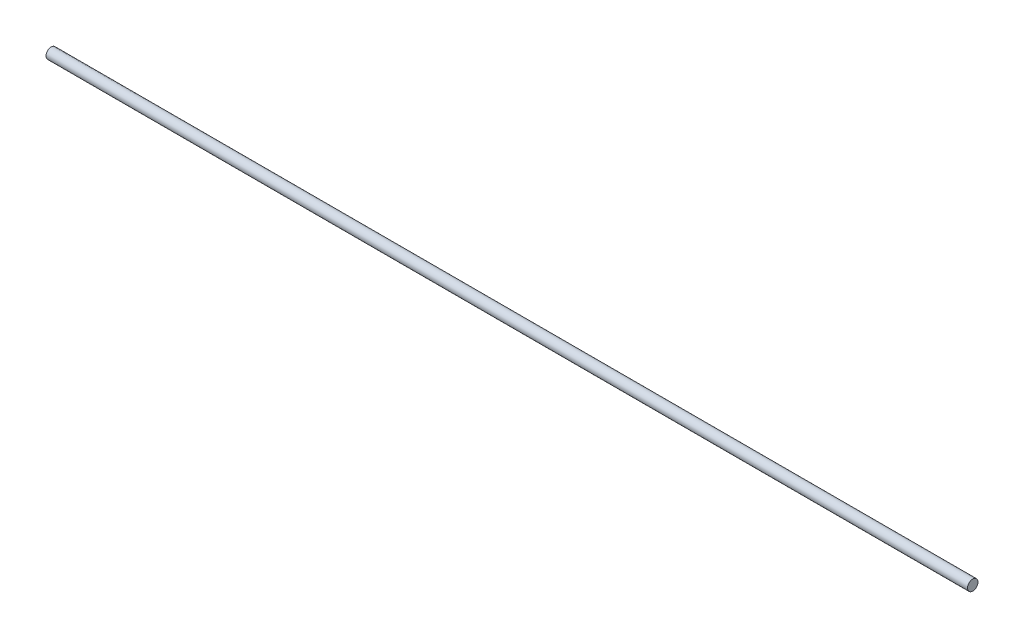
ISO-10303-21;
HEADER;
FILE_DESCRIPTION(('STEP AP214'),'2;1');
FILE_NAME('part.step','',(''),(''),'','','');
FILE_SCHEMA(('AUTOMOTIVE_DESIGN { 1 0 10303 214 1 1 1 1 }'));
ENDSEC;
DATA;
#1=APPLICATION_CONTEXT('core data for automotive mechanical design processes');
#2=APPLICATION_PROTOCOL_DEFINITION('international standard','automotive_design',2000,#1);
#3=PRODUCT_CONTEXT('',#1,'mechanical');
#4=PRODUCT('Part','Part','',(#3));
#5=PRODUCT_RELATED_PRODUCT_CATEGORY('part','',(#4));
#6=PRODUCT_DEFINITION_FORMATION('','',#4);
#7=PRODUCT_DEFINITION_CONTEXT('part definition',#1,'design');
#8=PRODUCT_DEFINITION('design','',#6,#7);
#9=PRODUCT_DEFINITION_SHAPE('','',#8);
#10=(LENGTH_UNIT() NAMED_UNIT(*) SI_UNIT(.MILLI.,.METRE.));
#11=(NAMED_UNIT(*) PLANE_ANGLE_UNIT() SI_UNIT($,.RADIAN.));
#12=(NAMED_UNIT(*) SI_UNIT($,.STERADIAN.) SOLID_ANGLE_UNIT());
#13=UNCERTAINTY_MEASURE_WITH_UNIT(LENGTH_MEASURE(1.E-05),#10,'distance_accuracy_value','');
#14=(GEOMETRIC_REPRESENTATION_CONTEXT(3) GLOBAL_UNCERTAINTY_ASSIGNED_CONTEXT((#13)) GLOBAL_UNIT_ASSIGNED_CONTEXT((#10,
#11,#12)) REPRESENTATION_CONTEXT('',''));
#15=CARTESIAN_POINT('',(0.,0.,0.));
#16=DIRECTION('',(0.,0.,1.));
#17=DIRECTION('',(1.,0.,0.));
#18=AXIS2_PLACEMENT_3D('',#15,#16,#17);
#19=CARTESIAN_POINT('',(880.,0.,0.));
#20=DIRECTION('',(-1.,0.,0.));
#21=DIRECTION('',(0.,0.,1.));
#22=AXIS2_PLACEMENT_3D('',#19,#20,#21);
#23=CYLINDRICAL_SURFACE('',#22,5.);
#24=CARTESIAN_POINT('',(880.,0.,0.));
#25=DIRECTION('',(1.,0.,0.));
#26=DIRECTION('',(0.,0.,-1.));
#27=AXIS2_PLACEMENT_3D('',#24,#25,#26);
#28=CIRCLE('',#27,5.);
#29=CARTESIAN_POINT('',(880.,0.,-5.));
#30=VERTEX_POINT('',#29);
#31=EDGE_CURVE('E10',#30,#30,#28,.T.);
#32=ORIENTED_EDGE('',*,*,#31,.F.);
#33=EDGE_LOOP('',(#32));
#34=FACE_BOUND('',#33,.T.);
#35=CARTESIAN_POINT('',(0.,0.,0.));
#36=DIRECTION('',(1.,0.,0.));
#37=DIRECTION('',(0.,0.,-1.));
#38=AXIS2_PLACEMENT_3D('',#35,#36,#37);
#39=CIRCLE('',#38,5.);
#40=CARTESIAN_POINT('',(0.,0.,-5.));
#41=VERTEX_POINT('',#40);
#42=EDGE_CURVE('E44',#41,#41,#39,.T.);
#43=ORIENTED_EDGE('',*,*,#42,.T.);
#44=EDGE_LOOP('',(#43));
#45=FACE_BOUND('',#44,.T.);
#46=ADVANCED_FACE('F41',(#34,#45),#23,.T.);
#47=CARTESIAN_POINT('',(880.,0.,0.));
#48=DIRECTION('',(1.,0.,0.));
#49=DIRECTION('',(0.,0.,-1.));
#50=AXIS2_PLACEMENT_3D('',#47,#48,#49);
#51=PLANE('',#50);
#52=ORIENTED_EDGE('',*,*,#31,.T.);
#53=EDGE_LOOP('',(#52));
#54=FACE_BOUND('',#53,.T.);
#55=ADVANCED_FACE('F58',(#54),#51,.T.);
#56=CARTESIAN_POINT('',(0.,0.,0.));
#57=DIRECTION('',(1.,0.,0.));
#58=DIRECTION('',(0.,0.,-1.));
#59=AXIS2_PLACEMENT_3D('',#56,#57,#58);
#60=PLANE('',#59);
#61=ORIENTED_EDGE('',*,*,#42,.F.);
#62=EDGE_LOOP('',(#61));
#63=FACE_BOUND('',#62,.T.);
#64=ADVANCED_FACE('F56',(#63),#60,.F.);
#65=CLOSED_SHELL('',(#46,#55,#64));
#66=MANIFOLD_SOLID_BREP('B2',#65);
#67=ADVANCED_BREP_SHAPE_REPRESENTATION('',(#18,#66),#14);
#68=SHAPE_DEFINITION_REPRESENTATION(#9,#67);
ENDSEC;
END-ISO-10303-21;
